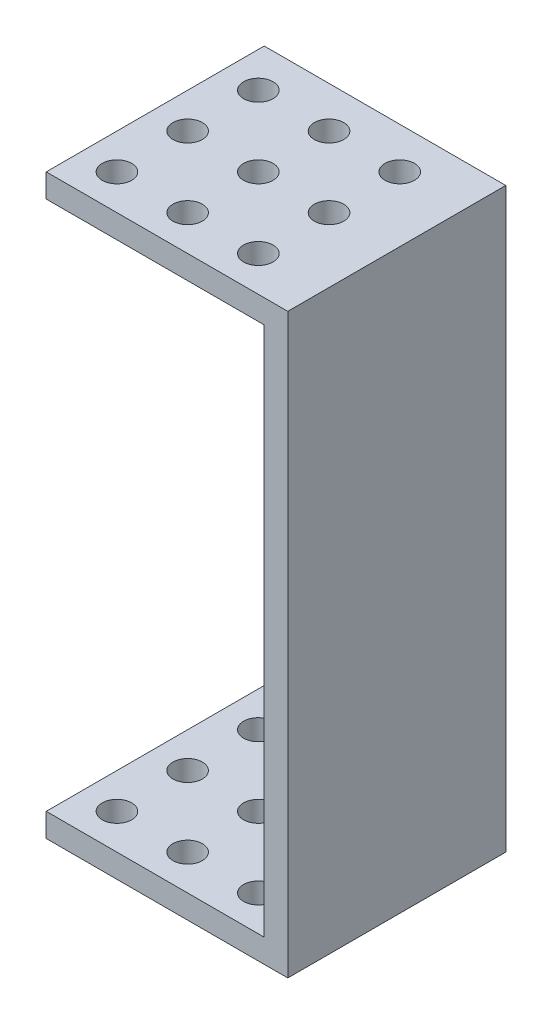
ISO-10303-21;
HEADER;
FILE_DESCRIPTION(('STEP AP214'),'2;1');
FILE_NAME('part.step','',(''),(''),'','','');
FILE_SCHEMA(('AUTOMOTIVE_DESIGN { 1 0 10303 214 1 1 1 1 }'));
ENDSEC;
DATA;
#1=APPLICATION_CONTEXT('core data for automotive mechanical design processes');
#2=APPLICATION_PROTOCOL_DEFINITION('international standard','automotive_design',2000,#1);
#3=PRODUCT_CONTEXT('',#1,'mechanical');
#4=PRODUCT('Part','Part','',(#3));
#5=PRODUCT_RELATED_PRODUCT_CATEGORY('part','',(#4));
#6=PRODUCT_DEFINITION_FORMATION('','',#4);
#7=PRODUCT_DEFINITION_CONTEXT('part definition',#1,'design');
#8=PRODUCT_DEFINITION('design','',#6,#7);
#9=PRODUCT_DEFINITION_SHAPE('','',#8);
#10=(LENGTH_UNIT() NAMED_UNIT(*) SI_UNIT(.MILLI.,.METRE.));
#11=(NAMED_UNIT(*) PLANE_ANGLE_UNIT() SI_UNIT($,.RADIAN.));
#12=(NAMED_UNIT(*) SI_UNIT($,.STERADIAN.) SOLID_ANGLE_UNIT());
#13=UNCERTAINTY_MEASURE_WITH_UNIT(LENGTH_MEASURE(1.E-05),#10,'distance_accuracy_value','');
#14=(GEOMETRIC_REPRESENTATION_CONTEXT(3) GLOBAL_UNCERTAINTY_ASSIGNED_CONTEXT((#13)) GLOBAL_UNIT_ASSIGNED_CONTEXT((#10,
#11,#12)) REPRESENTATION_CONTEXT('',''));
#15=CARTESIAN_POINT('',(0.,0.,0.));
#16=DIRECTION('',(0.,0.,1.));
#17=DIRECTION('',(1.,0.,0.));
#18=AXIS2_PLACEMENT_3D('',#15,#16,#17);
#19=CARTESIAN_POINT('',(-10.25,2.,9.25));
#20=DIRECTION('',(1.,0.,0.));
#21=DIRECTION('',(0.,0.,-1.));
#22=AXIS2_PLACEMENT_3D('',#19,#20,#21);
#23=PLANE('',#22);
#24=DIRECTION('',(0.,0.,1.));
#25=VECTOR('',#24,1.);
#26=CARTESIAN_POINT('',(-10.25,0.,9.25));
#27=LINE('',#26,#25);
#28=CARTESIAN_POINT('',(-10.25,0.,-9.25));
#29=VERTEX_POINT('',#28);
#30=CARTESIAN_POINT('',(-10.25,0.,9.25));
#31=VERTEX_POINT('',#30);
#32=EDGE_CURVE('E90',#29,#31,#27,.T.);
#33=ORIENTED_EDGE('',*,*,#32,.T.);
#34=DIRECTION('',(0.,-1.,0.));
#35=VECTOR('',#34,1.);
#36=CARTESIAN_POINT('',(-10.25,2.,9.25));
#37=LINE('',#36,#35);
#38=CARTESIAN_POINT('',(-10.25,2.,9.25));
#39=VERTEX_POINT('',#38);
#40=EDGE_CURVE('E111',#39,#31,#37,.T.);
#41=ORIENTED_EDGE('',*,*,#40,.F.);
#42=DIRECTION('',(0.,0.,1.));
#43=VECTOR('',#42,1.);
#44=CARTESIAN_POINT('',(-10.25,2.,9.25));
#45=LINE('',#44,#43);
#46=CARTESIAN_POINT('',(-10.25,2.,-9.25));
#47=VERTEX_POINT('',#46);
#48=EDGE_CURVE('E84',#47,#39,#45,.T.);
#49=ORIENTED_EDGE('',*,*,#48,.F.);
#50=DIRECTION('',(0.,-1.,0.));
#51=VECTOR('',#50,1.);
#52=CARTESIAN_POINT('',(-10.25,2.,-9.25));
#53=LINE('',#52,#51);
#54=EDGE_CURVE('E76',#47,#29,#53,.T.);
#55=ORIENTED_EDGE('',*,*,#54,.T.);
#56=EDGE_LOOP('',(#33,#41,#49,#55));
#57=FACE_BOUND('',#56,.T.);
#58=ADVANCED_FACE('F33',(#57),#23,.F.);
#59=CARTESIAN_POINT('',(10.25,2.,9.25));
#60=DIRECTION('',(0.,0.,-1.));
#61=DIRECTION('',(-1.,0.,0.));
#62=AXIS2_PLACEMENT_3D('',#59,#60,#61);
#63=PLANE('',#62);
#64=DIRECTION('',(1.,0.,0.));
#65=VECTOR('',#64,1.);
#66=CARTESIAN_POINT('',(10.25,0.,9.25));
#67=LINE('',#66,#65);
#68=CARTESIAN_POINT('',(10.25,0.,9.25));
#69=VERTEX_POINT('',#68);
#70=EDGE_CURVE('E94',#31,#69,#67,.T.);
#71=ORIENTED_EDGE('',*,*,#70,.T.);
#72=DIRECTION('',(0.,-1.,0.));
#73=VECTOR('',#72,1.);
#74=CARTESIAN_POINT('',(10.25,2.,9.25));
#75=LINE('',#74,#73);
#76=CARTESIAN_POINT('',(10.25,49.,9.25));
#77=VERTEX_POINT('',#76);
#78=EDGE_CURVE('E108',#77,#69,#75,.T.);
#79=ORIENTED_EDGE('',*,*,#78,.F.);
#80=DIRECTION('',(1.,0.,0.));
#81=VECTOR('',#80,1.);
#82=CARTESIAN_POINT('',(-10.25,49.,9.25));
#83=LINE('',#82,#81);
#84=CARTESIAN_POINT('',(-10.25,49.,9.25));
#85=VERTEX_POINT('',#84);
#86=EDGE_CURVE('E365',#85,#77,#83,.T.);
#87=ORIENTED_EDGE('',*,*,#86,.F.);
#88=DIRECTION('',(0.,-1.,0.));
#89=VECTOR('',#88,1.);
#90=CARTESIAN_POINT('',(-10.25,49.,9.25));
#91=LINE('',#90,#89);
#92=CARTESIAN_POINT('',(-10.25,47.,9.25));
#93=VERTEX_POINT('',#92);
#94=EDGE_CURVE('E368',#85,#93,#91,.T.);
#95=ORIENTED_EDGE('',*,*,#94,.T.);
#96=DIRECTION('',(1.,0.,0.));
#97=VECTOR('',#96,1.);
#98=CARTESIAN_POINT('',(-10.25,47.,9.25));
#99=LINE('',#98,#97);
#100=CARTESIAN_POINT('',(8.25,47.,9.25));
#101=VERTEX_POINT('',#100);
#102=EDGE_CURVE('E359',#93,#101,#99,.T.);
#103=ORIENTED_EDGE('',*,*,#102,.T.);
#104=DIRECTION('',(0.,-1.,0.));
#105=VECTOR('',#104,1.);
#106=CARTESIAN_POINT('',(8.25,47.,9.25));
#107=LINE('',#106,#105);
#108=CARTESIAN_POINT('',(8.25,2.,9.25));
#109=VERTEX_POINT('',#108);
#110=EDGE_CURVE('E100',#101,#109,#107,.T.);
#111=ORIENTED_EDGE('',*,*,#110,.T.);
#112=DIRECTION('',(1.,0.,0.));
#113=VECTOR('',#112,1.);
#114=CARTESIAN_POINT('',(10.25,2.,9.25));
#115=LINE('',#114,#113);
#116=EDGE_CURVE('E114',#39,#109,#115,.T.);
#117=ORIENTED_EDGE('',*,*,#116,.F.);
#118=ORIENTED_EDGE('',*,*,#40,.T.);
#119=EDGE_LOOP('',(#71,#79,#87,#95,#103,#111,#117,#118));
#120=FACE_BOUND('',#119,.T.);
#121=ADVANCED_FACE('F239',(#120),#63,.F.);
#122=CARTESIAN_POINT('',(10.25,2.,9.25));
#123=DIRECTION('',(-1.,0.,0.));
#124=DIRECTION('',(0.,0.,1.));
#125=AXIS2_PLACEMENT_3D('',#122,#123,#124);
#126=PLANE('',#125);
#127=DIRECTION('',(0.,0.,-1.));
#128=VECTOR('',#127,1.);
#129=CARTESIAN_POINT('',(10.25,0.,9.25));
#130=LINE('',#129,#128);
#131=CARTESIAN_POINT('',(10.25,0.,-9.25));
#132=VERTEX_POINT('',#131);
#133=EDGE_CURVE('E85',#69,#132,#130,.T.);
#134=ORIENTED_EDGE('',*,*,#133,.T.);
#135=DIRECTION('',(0.,-1.,0.));
#136=VECTOR('',#135,1.);
#137=CARTESIAN_POINT('',(10.25,2.,-9.25));
#138=LINE('',#137,#136);
#139=CARTESIAN_POINT('',(10.25,49.,-9.25));
#140=VERTEX_POINT('',#139);
#141=EDGE_CURVE('E80',#140,#132,#138,.T.);
#142=ORIENTED_EDGE('',*,*,#141,.F.);
#143=DIRECTION('',(0.,0.,-1.));
#144=VECTOR('',#143,1.);
#145=CARTESIAN_POINT('',(10.25,49.,-9.25));
#146=LINE('',#145,#144);
#147=EDGE_CURVE('E355',#77,#140,#146,.T.);
#148=ORIENTED_EDGE('',*,*,#147,.F.);
#149=ORIENTED_EDGE('',*,*,#78,.T.);
#150=EDGE_LOOP('',(#134,#142,#148,#149));
#151=FACE_BOUND('',#150,.T.);
#152=ADVANCED_FACE('F244',(#151),#126,.F.);
#153=CARTESIAN_POINT('',(10.25,2.,-9.25));
#154=DIRECTION('',(0.,0.,1.));
#155=DIRECTION('',(1.,0.,0.));
#156=AXIS2_PLACEMENT_3D('',#153,#154,#155);
#157=PLANE('',#156);
#158=DIRECTION('',(-1.,0.,0.));
#159=VECTOR('',#158,1.);
#160=CARTESIAN_POINT('',(10.25,0.,-9.25));
#161=LINE('',#160,#159);
#162=EDGE_CURVE('E73',#132,#29,#161,.T.);
#163=ORIENTED_EDGE('',*,*,#162,.T.);
#164=ORIENTED_EDGE('',*,*,#54,.F.);
#165=DIRECTION('',(-1.,0.,0.));
#166=VECTOR('',#165,1.);
#167=CARTESIAN_POINT('',(10.25,2.,-9.25));
#168=LINE('',#167,#166);
#169=CARTESIAN_POINT('',(8.25,2.,-9.25));
#170=VERTEX_POINT('',#169);
#171=EDGE_CURVE('E53',#170,#47,#168,.T.);
#172=ORIENTED_EDGE('',*,*,#171,.F.);
#173=DIRECTION('',(0.,-1.,0.));
#174=VECTOR('',#173,1.);
#175=CARTESIAN_POINT('',(8.25,47.,-9.25));
#176=LINE('',#175,#174);
#177=CARTESIAN_POINT('',(8.25,47.,-9.25));
#178=VERTEX_POINT('',#177);
#179=EDGE_CURVE('E96',#178,#170,#176,.T.);
#180=ORIENTED_EDGE('',*,*,#179,.F.);
#181=DIRECTION('',(-1.,0.,0.));
#182=VECTOR('',#181,1.);
#183=CARTESIAN_POINT('',(-10.25,47.,-9.25));
#184=LINE('',#183,#182);
#185=CARTESIAN_POINT('',(-10.25,47.,-9.25));
#186=VERTEX_POINT('',#185);
#187=EDGE_CURVE('E354',#178,#186,#184,.T.);
#188=ORIENTED_EDGE('',*,*,#187,.T.);
#189=DIRECTION('',(0.,-1.,0.));
#190=VECTOR('',#189,1.);
#191=CARTESIAN_POINT('',(-10.25,49.,-9.25));
#192=LINE('',#191,#190);
#193=CARTESIAN_POINT('',(-10.25,49.,-9.25));
#194=VERTEX_POINT('',#193);
#195=EDGE_CURVE('E126',#194,#186,#192,.T.);
#196=ORIENTED_EDGE('',*,*,#195,.F.);
#197=DIRECTION('',(-1.,0.,0.));
#198=VECTOR('',#197,1.);
#199=CARTESIAN_POINT('',(-10.25,49.,-9.25));
#200=LINE('',#199,#198);
#201=EDGE_CURVE('E358',#140,#194,#200,.T.);
#202=ORIENTED_EDGE('',*,*,#201,.F.);
#203=ORIENTED_EDGE('',*,*,#141,.T.);
#204=EDGE_LOOP('',(#163,#164,#172,#180,#188,#196,#202,#203));
#205=FACE_BOUND('',#204,.T.);
#206=ADVANCED_FACE('F75',(#205),#157,.F.);
#207=CARTESIAN_POINT('',(0.,2.,0.));
#208=DIRECTION('',(0.,1.,0.));
#209=DIRECTION('',(0.,0.,1.));
#210=AXIS2_PLACEMENT_3D('',#207,#208,#209);
#211=PLANE('',#210);
#212=CARTESIAN_POINT('',(-7.25,2.,0.250000000000001));
#213=DIRECTION('',(0.,1.,0.));
#214=DIRECTION('',(0.,0.,1.));
#215=AXIS2_PLACEMENT_3D('',#212,#213,#214);
#216=CIRCLE('',#215,1.25);
#217=CARTESIAN_POINT('',(-7.25,2.,1.5));
#218=VERTEX_POINT('',#217);
#219=EDGE_CURVE('E333',#218,#218,#216,.T.);
#220=ORIENTED_EDGE('',*,*,#219,.F.);
#221=EDGE_LOOP('',(#220));
#222=FACE_BOUND('',#221,.T.);
#223=CARTESIAN_POINT('',(-7.25,2.,6.25));
#224=DIRECTION('',(0.,1.,0.));
#225=DIRECTION('',(0.,0.,1.));
#226=AXIS2_PLACEMENT_3D('',#223,#224,#225);
#227=CIRCLE('',#226,1.25);
#228=CARTESIAN_POINT('',(-7.25,2.,7.5));
#229=VERTEX_POINT('',#228);
#230=EDGE_CURVE('E351',#229,#229,#227,.T.);
#231=ORIENTED_EDGE('',*,*,#230,.F.);
#232=EDGE_LOOP('',(#231));
#233=FACE_BOUND('',#232,.T.);
#234=DIRECTION('',(0.,0.,1.));
#235=VECTOR('',#234,1.);
#236=CARTESIAN_POINT('',(8.25,2.,9.25));
#237=LINE('',#236,#235);
#238=EDGE_CURVE('E48',#170,#109,#237,.T.);
#239=ORIENTED_EDGE('',*,*,#238,.F.);
#240=ORIENTED_EDGE('',*,*,#171,.T.);
#241=ORIENTED_EDGE('',*,*,#48,.T.);
#242=ORIENTED_EDGE('',*,*,#116,.T.);
#243=EDGE_LOOP('',(#239,#240,#241,#242));
#244=FACE_BOUND('',#243,.T.);
#245=CARTESIAN_POINT('',(-7.25,2.,-5.75));
#246=DIRECTION('',(0.,1.,0.));
#247=DIRECTION('',(0.,0.,1.));
#248=AXIS2_PLACEMENT_3D('',#245,#246,#247);
#249=CIRCLE('',#248,1.25);
#250=CARTESIAN_POINT('',(-7.25,2.,-4.5));
#251=VERTEX_POINT('',#250);
#252=EDGE_CURVE('E113',#251,#251,#249,.T.);
#253=ORIENTED_EDGE('',*,*,#252,.F.);
#254=EDGE_LOOP('',(#253));
#255=FACE_BOUND('',#254,.T.);
#256=CARTESIAN_POINT('',(-1.25,2.,6.25));
#257=DIRECTION('',(0.,1.,0.));
#258=DIRECTION('',(0.,0.,1.));
#259=AXIS2_PLACEMENT_3D('',#256,#257,#258);
#260=CIRCLE('',#259,1.25);
#261=CARTESIAN_POINT('',(-1.25,2.,7.5));
#262=VERTEX_POINT('',#261);
#263=EDGE_CURVE('E140',#262,#262,#260,.T.);
#264=ORIENTED_EDGE('',*,*,#263,.F.);
#265=EDGE_LOOP('',(#264));
#266=FACE_BOUND('',#265,.T.);
#267=CARTESIAN_POINT('',(-1.25,2.,0.25));
#268=DIRECTION('',(0.,1.,0.));
#269=DIRECTION('',(0.,0.,1.));
#270=AXIS2_PLACEMENT_3D('',#267,#268,#269);
#271=CIRCLE('',#270,1.25);
#272=CARTESIAN_POINT('',(-1.25,2.,1.5));
#273=VERTEX_POINT('',#272);
#274=EDGE_CURVE('E146',#273,#273,#271,.T.);
#275=ORIENTED_EDGE('',*,*,#274,.F.);
#276=EDGE_LOOP('',(#275));
#277=FACE_BOUND('',#276,.T.);
#278=CARTESIAN_POINT('',(-1.25,2.,-5.75));
#279=DIRECTION('',(0.,1.,0.));
#280=DIRECTION('',(0.,0.,1.));
#281=AXIS2_PLACEMENT_3D('',#278,#279,#280);
#282=CIRCLE('',#281,1.25);
#283=CARTESIAN_POINT('',(-1.25,2.,-4.5));
#284=VERTEX_POINT('',#283);
#285=EDGE_CURVE('E152',#284,#284,#282,.T.);
#286=ORIENTED_EDGE('',*,*,#285,.F.);
#287=EDGE_LOOP('',(#286));
#288=FACE_BOUND('',#287,.T.);
#289=CARTESIAN_POINT('',(4.75,2.,6.25));
#290=DIRECTION('',(0.,1.,0.));
#291=DIRECTION('',(0.,0.,1.));
#292=AXIS2_PLACEMENT_3D('',#289,#290,#291);
#293=CIRCLE('',#292,1.25);
#294=CARTESIAN_POINT('',(4.75,2.,7.5));
#295=VERTEX_POINT('',#294);
#296=EDGE_CURVE('E158',#295,#295,#293,.T.);
#297=ORIENTED_EDGE('',*,*,#296,.F.);
#298=EDGE_LOOP('',(#297));
#299=FACE_BOUND('',#298,.T.);
#300=CARTESIAN_POINT('',(4.75,2.,0.249999999999999));
#301=DIRECTION('',(0.,1.,0.));
#302=DIRECTION('',(0.,0.,1.));
#303=AXIS2_PLACEMENT_3D('',#300,#301,#302);
#304=CIRCLE('',#303,1.25);
#305=CARTESIAN_POINT('',(4.75,2.,1.5));
#306=VERTEX_POINT('',#305);
#307=EDGE_CURVE('E164',#306,#306,#304,.T.);
#308=ORIENTED_EDGE('',*,*,#307,.F.);
#309=EDGE_LOOP('',(#308));
#310=FACE_BOUND('',#309,.T.);
#311=CARTESIAN_POINT('',(4.75,2.,-5.75));
#312=DIRECTION('',(0.,1.,0.));
#313=DIRECTION('',(0.,0.,1.));
#314=AXIS2_PLACEMENT_3D('',#311,#312,#313);
#315=CIRCLE('',#314,1.25);
#316=CARTESIAN_POINT('',(4.75,2.,-4.5));
#317=VERTEX_POINT('',#316);
#318=EDGE_CURVE('E170',#317,#317,#315,.T.);
#319=ORIENTED_EDGE('',*,*,#318,.F.);
#320=EDGE_LOOP('',(#319));
#321=FACE_BOUND('',#320,.T.);
#322=ADVANCED_FACE('F415',(#222,#233,#244,#255,#266,#277,#288,#299,#310,#321),#211,.T.);
#323=CARTESIAN_POINT('',(0.,0.,0.));
#324=DIRECTION('',(0.,1.,0.));
#325=DIRECTION('',(0.,0.,1.));
#326=AXIS2_PLACEMENT_3D('',#323,#324,#325);
#327=PLANE('',#326);
#328=CARTESIAN_POINT('',(-7.25,0.,0.250000000000001));
#329=DIRECTION('',(0.,-1.,0.));
#330=DIRECTION('',(0.,0.,-1.));
#331=AXIS2_PLACEMENT_3D('',#328,#329,#330);
#332=CIRCLE('',#331,1.25);
#333=CARTESIAN_POINT('',(-7.25,0.,-0.999999999999999));
#334=VERTEX_POINT('',#333);
#335=EDGE_CURVE('E336',#334,#334,#332,.T.);
#336=ORIENTED_EDGE('',*,*,#335,.F.);
#337=EDGE_LOOP('',(#336));
#338=FACE_BOUND('',#337,.T.);
#339=CARTESIAN_POINT('',(-7.25,0.,6.25));
#340=DIRECTION('',(0.,-1.,0.));
#341=DIRECTION('',(0.,0.,-1.));
#342=AXIS2_PLACEMENT_3D('',#339,#340,#341);
#343=CIRCLE('',#342,1.25);
#344=CARTESIAN_POINT('',(-7.25,0.,5.));
#345=VERTEX_POINT('',#344);
#346=EDGE_CURVE('E342',#345,#345,#343,.T.);
#347=ORIENTED_EDGE('',*,*,#346,.F.);
#348=EDGE_LOOP('',(#347));
#349=FACE_BOUND('',#348,.T.);
#350=ORIENTED_EDGE('',*,*,#32,.F.);
#351=ORIENTED_EDGE('',*,*,#162,.F.);
#352=ORIENTED_EDGE('',*,*,#133,.F.);
#353=ORIENTED_EDGE('',*,*,#70,.F.);
#354=EDGE_LOOP('',(#350,#351,#352,#353));
#355=FACE_BOUND('',#354,.T.);
#356=CARTESIAN_POINT('',(-7.25,0.,-5.75));
#357=DIRECTION('',(0.,-1.,0.));
#358=DIRECTION('',(0.,0.,-1.));
#359=AXIS2_PLACEMENT_3D('',#356,#357,#358);
#360=CIRCLE('',#359,1.25);
#361=CARTESIAN_POINT('',(-7.25,0.,-7.));
#362=VERTEX_POINT('',#361);
#363=EDGE_CURVE('E137',#362,#362,#360,.T.);
#364=ORIENTED_EDGE('',*,*,#363,.F.);
#365=EDGE_LOOP('',(#364));
#366=FACE_BOUND('',#365,.T.);
#367=CARTESIAN_POINT('',(-1.25,0.,6.25));
#368=DIRECTION('',(0.,-1.,0.));
#369=DIRECTION('',(0.,0.,-1.));
#370=AXIS2_PLACEMENT_3D('',#367,#368,#369);
#371=CIRCLE('',#370,1.25);
#372=CARTESIAN_POINT('',(-1.25,0.,5.));
#373=VERTEX_POINT('',#372);
#374=EDGE_CURVE('E143',#373,#373,#371,.T.);
#375=ORIENTED_EDGE('',*,*,#374,.F.);
#376=EDGE_LOOP('',(#375));
#377=FACE_BOUND('',#376,.T.);
#378=CARTESIAN_POINT('',(-1.25,0.,0.25));
#379=DIRECTION('',(0.,-1.,0.));
#380=DIRECTION('',(0.,0.,-1.));
#381=AXIS2_PLACEMENT_3D('',#378,#379,#380);
#382=CIRCLE('',#381,1.25);
#383=CARTESIAN_POINT('',(-1.25,0.,-1.));
#384=VERTEX_POINT('',#383);
#385=EDGE_CURVE('E149',#384,#384,#382,.T.);
#386=ORIENTED_EDGE('',*,*,#385,.F.);
#387=EDGE_LOOP('',(#386));
#388=FACE_BOUND('',#387,.T.);
#389=CARTESIAN_POINT('',(-1.25,0.,-5.75));
#390=DIRECTION('',(0.,-1.,0.));
#391=DIRECTION('',(0.,0.,-1.));
#392=AXIS2_PLACEMENT_3D('',#389,#390,#391);
#393=CIRCLE('',#392,1.25);
#394=CARTESIAN_POINT('',(-1.25,0.,-7.));
#395=VERTEX_POINT('',#394);
#396=EDGE_CURVE('E155',#395,#395,#393,.T.);
#397=ORIENTED_EDGE('',*,*,#396,.F.);
#398=EDGE_LOOP('',(#397));
#399=FACE_BOUND('',#398,.T.);
#400=CARTESIAN_POINT('',(4.75,0.,6.25));
#401=DIRECTION('',(0.,-1.,0.));
#402=DIRECTION('',(0.,0.,-1.));
#403=AXIS2_PLACEMENT_3D('',#400,#401,#402);
#404=CIRCLE('',#403,1.25);
#405=CARTESIAN_POINT('',(4.75,0.,5.));
#406=VERTEX_POINT('',#405);
#407=EDGE_CURVE('E161',#406,#406,#404,.T.);
#408=ORIENTED_EDGE('',*,*,#407,.F.);
#409=EDGE_LOOP('',(#408));
#410=FACE_BOUND('',#409,.T.);
#411=CARTESIAN_POINT('',(4.75,0.,0.249999999999999));
#412=DIRECTION('',(0.,-1.,0.));
#413=DIRECTION('',(0.,0.,-1.));
#414=AXIS2_PLACEMENT_3D('',#411,#412,#413);
#415=CIRCLE('',#414,1.25);
#416=CARTESIAN_POINT('',(4.75,0.,-1.));
#417=VERTEX_POINT('',#416);
#418=EDGE_CURVE('E167',#417,#417,#415,.T.);
#419=ORIENTED_EDGE('',*,*,#418,.F.);
#420=EDGE_LOOP('',(#419));
#421=FACE_BOUND('',#420,.T.);
#422=CARTESIAN_POINT('',(4.75,0.,-5.75));
#423=DIRECTION('',(0.,-1.,0.));
#424=DIRECTION('',(0.,0.,-1.));
#425=AXIS2_PLACEMENT_3D('',#422,#423,#424);
#426=CIRCLE('',#425,1.25);
#427=CARTESIAN_POINT('',(4.75,0.,-7.));
#428=VERTEX_POINT('',#427);
#429=EDGE_CURVE('E173',#428,#428,#426,.T.);
#430=ORIENTED_EDGE('',*,*,#429,.F.);
#431=EDGE_LOOP('',(#430));
#432=FACE_BOUND('',#431,.T.);
#433=ADVANCED_FACE('F92',(#338,#349,#355,#366,#377,#388,#399,#410,#421,#432),#327,.F.);
#434=CARTESIAN_POINT('',(8.25,47.,9.25));
#435=DIRECTION('',(1.,0.,0.));
#436=DIRECTION('',(0.,0.,-1.));
#437=AXIS2_PLACEMENT_3D('',#434,#435,#436);
#438=PLANE('',#437);
#439=ORIENTED_EDGE('',*,*,#238,.T.);
#440=ORIENTED_EDGE('',*,*,#110,.F.);
#441=DIRECTION('',(0.,0.,1.));
#442=VECTOR('',#441,1.);
#443=CARTESIAN_POINT('',(8.25,47.,9.25));
#444=LINE('',#443,#442);
#445=EDGE_CURVE('E125',#178,#101,#444,.T.);
#446=ORIENTED_EDGE('',*,*,#445,.F.);
#447=ORIENTED_EDGE('',*,*,#179,.T.);
#448=EDGE_LOOP('',(#439,#440,#446,#447));
#449=FACE_BOUND('',#448,.T.);
#450=ADVANCED_FACE('F224',(#449),#438,.F.);
#451=CARTESIAN_POINT('',(0.,47.,0.));
#452=DIRECTION('',(0.,1.,0.));
#453=DIRECTION('',(0.,0.,1.));
#454=AXIS2_PLACEMENT_3D('',#451,#452,#453);
#455=PLANE('',#454);
#456=CARTESIAN_POINT('',(-7.25,47.,0.250000000000001));
#457=DIRECTION('',(0.,1.,0.));
#458=DIRECTION('',(0.,0.,1.));
#459=AXIS2_PLACEMENT_3D('',#456,#457,#458);
#460=CIRCLE('',#459,1.25);
#461=CARTESIAN_POINT('',(-7.25,47.,1.5));
#462=VERTEX_POINT('',#461);
#463=EDGE_CURVE('E332',#462,#462,#460,.T.);
#464=ORIENTED_EDGE('',*,*,#463,.T.);
#465=EDGE_LOOP('',(#464));
#466=FACE_BOUND('',#465,.T.);
#467=CARTESIAN_POINT('',(-7.25,47.,6.25));
#468=DIRECTION('',(0.,1.,0.));
#469=DIRECTION('',(0.,0.,1.));
#470=AXIS2_PLACEMENT_3D('',#467,#468,#469);
#471=CIRCLE('',#470,1.25);
#472=CARTESIAN_POINT('',(-7.25,47.,7.5));
#473=VERTEX_POINT('',#472);
#474=EDGE_CURVE('E346',#473,#473,#471,.T.);
#475=ORIENTED_EDGE('',*,*,#474,.T.);
#476=EDGE_LOOP('',(#475));
#477=FACE_BOUND('',#476,.T.);
#478=ORIENTED_EDGE('',*,*,#187,.F.);
#479=ORIENTED_EDGE('',*,*,#445,.T.);
#480=ORIENTED_EDGE('',*,*,#102,.F.);
#481=DIRECTION('',(0.,0.,1.));
#482=VECTOR('',#481,1.);
#483=CARTESIAN_POINT('',(-10.25,47.,-9.25));
#484=LINE('',#483,#482);
#485=EDGE_CURVE('E371',#186,#93,#484,.T.);
#486=ORIENTED_EDGE('',*,*,#485,.F.);
#487=EDGE_LOOP('',(#478,#479,#480,#486));
#488=FACE_BOUND('',#487,.T.);
#489=CARTESIAN_POINT('',(-7.25,47.,-5.75));
#490=DIRECTION('',(0.,1.,0.));
#491=DIRECTION('',(0.,0.,1.));
#492=AXIS2_PLACEMENT_3D('',#489,#490,#491);
#493=CIRCLE('',#492,1.25);
#494=CARTESIAN_POINT('',(-7.25,47.,-4.5));
#495=VERTEX_POINT('',#494);
#496=EDGE_CURVE('E179',#495,#495,#493,.T.);
#497=ORIENTED_EDGE('',*,*,#496,.T.);
#498=EDGE_LOOP('',(#497));
#499=FACE_BOUND('',#498,.T.);
#500=CARTESIAN_POINT('',(-1.25,47.,6.25));
#501=DIRECTION('',(0.,1.,0.));
#502=DIRECTION('',(0.,0.,1.));
#503=AXIS2_PLACEMENT_3D('',#500,#501,#502);
#504=CIRCLE('',#503,1.25);
#505=CARTESIAN_POINT('',(-1.25,47.,7.5));
#506=VERTEX_POINT('',#505);
#507=EDGE_CURVE('E185',#506,#506,#504,.T.);
#508=ORIENTED_EDGE('',*,*,#507,.T.);
#509=EDGE_LOOP('',(#508));
#510=FACE_BOUND('',#509,.T.);
#511=CARTESIAN_POINT('',(-1.25,47.,0.25));
#512=DIRECTION('',(0.,1.,0.));
#513=DIRECTION('',(0.,0.,1.));
#514=AXIS2_PLACEMENT_3D('',#511,#512,#513);
#515=CIRCLE('',#514,1.25);
#516=CARTESIAN_POINT('',(-1.25,47.,1.5));
#517=VERTEX_POINT('',#516);
#518=EDGE_CURVE('E191',#517,#517,#515,.T.);
#519=ORIENTED_EDGE('',*,*,#518,.T.);
#520=EDGE_LOOP('',(#519));
#521=FACE_BOUND('',#520,.T.);
#522=CARTESIAN_POINT('',(-1.25,47.,-5.75));
#523=DIRECTION('',(0.,1.,0.));
#524=DIRECTION('',(0.,0.,1.));
#525=AXIS2_PLACEMENT_3D('',#522,#523,#524);
#526=CIRCLE('',#525,1.25);
#527=CARTESIAN_POINT('',(-1.25,47.,-4.5));
#528=VERTEX_POINT('',#527);
#529=EDGE_CURVE('E197',#528,#528,#526,.T.);
#530=ORIENTED_EDGE('',*,*,#529,.T.);
#531=EDGE_LOOP('',(#530));
#532=FACE_BOUND('',#531,.T.);
#533=CARTESIAN_POINT('',(4.75,47.,6.25));
#534=DIRECTION('',(0.,1.,0.));
#535=DIRECTION('',(0.,0.,1.));
#536=AXIS2_PLACEMENT_3D('',#533,#534,#535);
#537=CIRCLE('',#536,1.25);
#538=CARTESIAN_POINT('',(4.75,47.,7.5));
#539=VERTEX_POINT('',#538);
#540=EDGE_CURVE('E203',#539,#539,#537,.T.);
#541=ORIENTED_EDGE('',*,*,#540,.T.);
#542=EDGE_LOOP('',(#541));
#543=FACE_BOUND('',#542,.T.);
#544=CARTESIAN_POINT('',(4.75,47.,0.249999999999999));
#545=DIRECTION('',(0.,1.,0.));
#546=DIRECTION('',(0.,0.,1.));
#547=AXIS2_PLACEMENT_3D('',#544,#545,#546);
#548=CIRCLE('',#547,1.25);
#549=CARTESIAN_POINT('',(4.75,47.,1.5));
#550=VERTEX_POINT('',#549);
#551=EDGE_CURVE('E209',#550,#550,#548,.T.);
#552=ORIENTED_EDGE('',*,*,#551,.T.);
#553=EDGE_LOOP('',(#552));
#554=FACE_BOUND('',#553,.T.);
#555=CARTESIAN_POINT('',(4.75,47.,-5.75));
#556=DIRECTION('',(0.,1.,0.));
#557=DIRECTION('',(0.,0.,1.));
#558=AXIS2_PLACEMENT_3D('',#555,#556,#557);
#559=CIRCLE('',#558,1.25);
#560=CARTESIAN_POINT('',(4.75,47.,-4.5));
#561=VERTEX_POINT('',#560);
#562=EDGE_CURVE('E11',#561,#561,#559,.T.);
#563=ORIENTED_EDGE('',*,*,#562,.T.);
#564=EDGE_LOOP('',(#563));
#565=FACE_BOUND('',#564,.T.);
#566=ADVANCED_FACE('F221',(#466,#477,#488,#499,#510,#521,#532,#543,#554,#565),#455,.F.);
#567=CARTESIAN_POINT('',(-10.25,49.,-9.25));
#568=DIRECTION('',(1.,0.,0.));
#569=DIRECTION('',(0.,0.,-1.));
#570=AXIS2_PLACEMENT_3D('',#567,#568,#569);
#571=PLANE('',#570);
#572=ORIENTED_EDGE('',*,*,#485,.T.);
#573=ORIENTED_EDGE('',*,*,#94,.F.);
#574=DIRECTION('',(0.,0.,1.));
#575=VECTOR('',#574,1.);
#576=CARTESIAN_POINT('',(-10.25,49.,-9.25));
#577=LINE('',#576,#575);
#578=EDGE_CURVE('E362',#194,#85,#577,.T.);
#579=ORIENTED_EDGE('',*,*,#578,.F.);
#580=ORIENTED_EDGE('',*,*,#195,.T.);
#581=EDGE_LOOP('',(#572,#573,#579,#580));
#582=FACE_BOUND('',#581,.T.);
#583=ADVANCED_FACE('F223',(#582),#571,.F.);
#584=CARTESIAN_POINT('',(0.,49.,0.));
#585=DIRECTION('',(0.,1.,0.));
#586=DIRECTION('',(0.,0.,1.));
#587=AXIS2_PLACEMENT_3D('',#584,#585,#586);
#588=PLANE('',#587);
#589=CARTESIAN_POINT('',(-7.25,49.,0.250000000000001));
#590=DIRECTION('',(0.,-1.,0.));
#591=DIRECTION('',(0.,0.,-1.));
#592=AXIS2_PLACEMENT_3D('',#589,#590,#591);
#593=CIRCLE('',#592,1.25);
#594=CARTESIAN_POINT('',(-7.25,49.,-0.999999999999999));
#595=VERTEX_POINT('',#594);
#596=EDGE_CURVE('E330',#595,#595,#593,.T.);
#597=ORIENTED_EDGE('',*,*,#596,.T.);
#598=EDGE_LOOP('',(#597));
#599=FACE_BOUND('',#598,.T.);
#600=CARTESIAN_POINT('',(-7.25,49.,6.25));
#601=DIRECTION('',(0.,-1.,0.));
#602=DIRECTION('',(0.,0.,-1.));
#603=AXIS2_PLACEMENT_3D('',#600,#601,#602);
#604=CIRCLE('',#603,1.25);
#605=CARTESIAN_POINT('',(-7.25,49.,5.));
#606=VERTEX_POINT('',#605);
#607=EDGE_CURVE('E343',#606,#606,#604,.T.);
#608=ORIENTED_EDGE('',*,*,#607,.T.);
#609=EDGE_LOOP('',(#608));
#610=FACE_BOUND('',#609,.T.);
#611=ORIENTED_EDGE('',*,*,#147,.T.);
#612=ORIENTED_EDGE('',*,*,#201,.T.);
#613=ORIENTED_EDGE('',*,*,#578,.T.);
#614=ORIENTED_EDGE('',*,*,#86,.T.);
#615=EDGE_LOOP('',(#611,#612,#613,#614));
#616=FACE_BOUND('',#615,.T.);
#617=CARTESIAN_POINT('',(-7.25,49.,-5.75));
#618=DIRECTION('',(0.,-1.,0.));
#619=DIRECTION('',(0.,0.,-1.));
#620=AXIS2_PLACEMENT_3D('',#617,#618,#619);
#621=CIRCLE('',#620,1.25);
#622=CARTESIAN_POINT('',(-7.25,49.,-7.));
#623=VERTEX_POINT('',#622);
#624=EDGE_CURVE('E176',#623,#623,#621,.T.);
#625=ORIENTED_EDGE('',*,*,#624,.T.);
#626=EDGE_LOOP('',(#625));
#627=FACE_BOUND('',#626,.T.);
#628=CARTESIAN_POINT('',(-1.25,49.,6.25));
#629=DIRECTION('',(0.,-1.,0.));
#630=DIRECTION('',(0.,0.,-1.));
#631=AXIS2_PLACEMENT_3D('',#628,#629,#630);
#632=CIRCLE('',#631,1.25);
#633=CARTESIAN_POINT('',(-1.25,49.,5.));
#634=VERTEX_POINT('',#633);
#635=EDGE_CURVE('E182',#634,#634,#632,.T.);
#636=ORIENTED_EDGE('',*,*,#635,.T.);
#637=EDGE_LOOP('',(#636));
#638=FACE_BOUND('',#637,.T.);
#639=CARTESIAN_POINT('',(-1.25,49.,0.25));
#640=DIRECTION('',(0.,-1.,0.));
#641=DIRECTION('',(0.,0.,-1.));
#642=AXIS2_PLACEMENT_3D('',#639,#640,#641);
#643=CIRCLE('',#642,1.25);
#644=CARTESIAN_POINT('',(-1.25,49.,-1.));
#645=VERTEX_POINT('',#644);
#646=EDGE_CURVE('E188',#645,#645,#643,.T.);
#647=ORIENTED_EDGE('',*,*,#646,.T.);
#648=EDGE_LOOP('',(#647));
#649=FACE_BOUND('',#648,.T.);
#650=CARTESIAN_POINT('',(-1.25,49.,-5.75));
#651=DIRECTION('',(0.,-1.,0.));
#652=DIRECTION('',(0.,0.,-1.));
#653=AXIS2_PLACEMENT_3D('',#650,#651,#652);
#654=CIRCLE('',#653,1.25);
#655=CARTESIAN_POINT('',(-1.25,49.,-7.));
#656=VERTEX_POINT('',#655);
#657=EDGE_CURVE('E194',#656,#656,#654,.T.);
#658=ORIENTED_EDGE('',*,*,#657,.T.);
#659=EDGE_LOOP('',(#658));
#660=FACE_BOUND('',#659,.T.);
#661=CARTESIAN_POINT('',(4.75,49.,6.25));
#662=DIRECTION('',(0.,-1.,0.));
#663=DIRECTION('',(0.,0.,-1.));
#664=AXIS2_PLACEMENT_3D('',#661,#662,#663);
#665=CIRCLE('',#664,1.25);
#666=CARTESIAN_POINT('',(4.75,49.,5.));
#667=VERTEX_POINT('',#666);
#668=EDGE_CURVE('E200',#667,#667,#665,.T.);
#669=ORIENTED_EDGE('',*,*,#668,.T.);
#670=EDGE_LOOP('',(#669));
#671=FACE_BOUND('',#670,.T.);
#672=CARTESIAN_POINT('',(4.75,49.,0.249999999999999));
#673=DIRECTION('',(0.,-1.,0.));
#674=DIRECTION('',(0.,0.,-1.));
#675=AXIS2_PLACEMENT_3D('',#672,#673,#674);
#676=CIRCLE('',#675,1.25);
#677=CARTESIAN_POINT('',(4.75,49.,-1.));
#678=VERTEX_POINT('',#677);
#679=EDGE_CURVE('E206',#678,#678,#676,.T.);
#680=ORIENTED_EDGE('',*,*,#679,.T.);
#681=EDGE_LOOP('',(#680));
#682=FACE_BOUND('',#681,.T.);
#683=CARTESIAN_POINT('',(4.75,49.,-5.75));
#684=DIRECTION('',(0.,-1.,0.));
#685=DIRECTION('',(0.,0.,-1.));
#686=AXIS2_PLACEMENT_3D('',#683,#684,#685);
#687=CIRCLE('',#686,1.25);
#688=CARTESIAN_POINT('',(4.75,49.,-7.));
#689=VERTEX_POINT('',#688);
#690=EDGE_CURVE('E41',#689,#689,#687,.T.);
#691=ORIENTED_EDGE('',*,*,#690,.T.);
#692=EDGE_LOOP('',(#691));
#693=FACE_BOUND('',#692,.T.);
#694=ADVANCED_FACE('F214',(#599,#610,#616,#627,#638,#649,#660,#671,#682,#693),#588,.T.);
#695=CARTESIAN_POINT('',(-7.25,49.,6.25));
#696=DIRECTION('',(0.,-1.,0.));
#697=DIRECTION('',(0.,0.,-1.));
#698=AXIS2_PLACEMENT_3D('',#695,#696,#697);
#699=CYLINDRICAL_SURFACE('',#698,1.25);
#700=ORIENTED_EDGE('',*,*,#607,.F.);
#701=EDGE_LOOP('',(#700));
#702=FACE_BOUND('',#701,.T.);
#703=ORIENTED_EDGE('',*,*,#474,.F.);
#704=EDGE_LOOP('',(#703));
#705=FACE_BOUND('',#704,.T.);
#706=ADVANCED_FACE('F308',(#702,#705),#699,.F.);
#707=ORIENTED_EDGE('',*,*,#230,.T.);
#708=EDGE_LOOP('',(#707));
#709=FACE_BOUND('',#708,.T.);
#710=ORIENTED_EDGE('',*,*,#346,.T.);
#711=EDGE_LOOP('',(#710));
#712=FACE_BOUND('',#711,.T.);
#713=ADVANCED_FACE('F313',(#709,#712),#699,.F.);
#714=CARTESIAN_POINT('',(-7.25,49.,0.250000000000001));
#715=DIRECTION('',(0.,-1.,0.));
#716=DIRECTION('',(0.,0.,-1.));
#717=AXIS2_PLACEMENT_3D('',#714,#715,#716);
#718=CYLINDRICAL_SURFACE('',#717,1.25);
#719=ORIENTED_EDGE('',*,*,#219,.T.);
#720=EDGE_LOOP('',(#719));
#721=FACE_BOUND('',#720,.T.);
#722=ORIENTED_EDGE('',*,*,#335,.T.);
#723=EDGE_LOOP('',(#722));
#724=FACE_BOUND('',#723,.T.);
#725=ADVANCED_FACE('F253',(#721,#724),#718,.F.);
#726=CARTESIAN_POINT('',(-7.25,49.,-5.75));
#727=DIRECTION('',(0.,-1.,0.));
#728=DIRECTION('',(0.,0.,-1.));
#729=AXIS2_PLACEMENT_3D('',#726,#727,#728);
#730=CYLINDRICAL_SURFACE('',#729,1.25);
#731=ORIENTED_EDGE('',*,*,#252,.T.);
#732=EDGE_LOOP('',(#731));
#733=FACE_BOUND('',#732,.T.);
#734=ORIENTED_EDGE('',*,*,#363,.T.);
#735=EDGE_LOOP('',(#734));
#736=FACE_BOUND('',#735,.T.);
#737=ADVANCED_FACE('F249',(#733,#736),#730,.F.);
#738=CARTESIAN_POINT('',(-1.25,49.,6.25));
#739=DIRECTION('',(0.,-1.,0.));
#740=DIRECTION('',(0.,0.,-1.));
#741=AXIS2_PLACEMENT_3D('',#738,#739,#740);
#742=CYLINDRICAL_SURFACE('',#741,1.25);
#743=ORIENTED_EDGE('',*,*,#263,.T.);
#744=EDGE_LOOP('',(#743));
#745=FACE_BOUND('',#744,.T.);
#746=ORIENTED_EDGE('',*,*,#374,.T.);
#747=EDGE_LOOP('',(#746));
#748=FACE_BOUND('',#747,.T.);
#749=ADVANCED_FACE('F252',(#745,#748),#742,.F.);
#750=CARTESIAN_POINT('',(-1.25,49.,0.25));
#751=DIRECTION('',(0.,-1.,0.));
#752=DIRECTION('',(0.,0.,-1.));
#753=AXIS2_PLACEMENT_3D('',#750,#751,#752);
#754=CYLINDRICAL_SURFACE('',#753,1.25);
#755=ORIENTED_EDGE('',*,*,#274,.T.);
#756=EDGE_LOOP('',(#755));
#757=FACE_BOUND('',#756,.T.);
#758=ORIENTED_EDGE('',*,*,#385,.T.);
#759=EDGE_LOOP('',(#758));
#760=FACE_BOUND('',#759,.T.);
#761=ADVANCED_FACE('F257',(#757,#760),#754,.F.);
#762=CARTESIAN_POINT('',(-1.25,49.,-5.75));
#763=DIRECTION('',(0.,-1.,0.));
#764=DIRECTION('',(0.,0.,-1.));
#765=AXIS2_PLACEMENT_3D('',#762,#763,#764);
#766=CYLINDRICAL_SURFACE('',#765,1.25);
#767=ORIENTED_EDGE('',*,*,#285,.T.);
#768=EDGE_LOOP('',(#767));
#769=FACE_BOUND('',#768,.T.);
#770=ORIENTED_EDGE('',*,*,#396,.T.);
#771=EDGE_LOOP('',(#770));
#772=FACE_BOUND('',#771,.T.);
#773=ADVANCED_FACE('F261',(#769,#772),#766,.F.);
#774=CARTESIAN_POINT('',(4.75,49.,6.25));
#775=DIRECTION('',(0.,-1.,0.));
#776=DIRECTION('',(0.,0.,-1.));
#777=AXIS2_PLACEMENT_3D('',#774,#775,#776);
#778=CYLINDRICAL_SURFACE('',#777,1.25);
#779=ORIENTED_EDGE('',*,*,#296,.T.);
#780=EDGE_LOOP('',(#779));
#781=FACE_BOUND('',#780,.T.);
#782=ORIENTED_EDGE('',*,*,#407,.T.);
#783=EDGE_LOOP('',(#782));
#784=FACE_BOUND('',#783,.T.);
#785=ADVANCED_FACE('F265',(#781,#784),#778,.F.);
#786=CARTESIAN_POINT('',(4.75,49.,0.249999999999999));
#787=DIRECTION('',(0.,-1.,0.));
#788=DIRECTION('',(0.,0.,-1.));
#789=AXIS2_PLACEMENT_3D('',#786,#787,#788);
#790=CYLINDRICAL_SURFACE('',#789,1.25);
#791=ORIENTED_EDGE('',*,*,#307,.T.);
#792=EDGE_LOOP('',(#791));
#793=FACE_BOUND('',#792,.T.);
#794=ORIENTED_EDGE('',*,*,#418,.T.);
#795=EDGE_LOOP('',(#794));
#796=FACE_BOUND('',#795,.T.);
#797=ADVANCED_FACE('F269',(#793,#796),#790,.F.);
#798=CARTESIAN_POINT('',(4.75,49.,-5.75));
#799=DIRECTION('',(0.,-1.,0.));
#800=DIRECTION('',(0.,0.,-1.));
#801=AXIS2_PLACEMENT_3D('',#798,#799,#800);
#802=CYLINDRICAL_SURFACE('',#801,1.25);
#803=ORIENTED_EDGE('',*,*,#318,.T.);
#804=EDGE_LOOP('',(#803));
#805=FACE_BOUND('',#804,.T.);
#806=ORIENTED_EDGE('',*,*,#429,.T.);
#807=EDGE_LOOP('',(#806));
#808=FACE_BOUND('',#807,.T.);
#809=ADVANCED_FACE('F273',(#805,#808),#802,.F.);
#810=CARTESIAN_POINT('',(-7.25,49.,0.250000000000001));
#811=DIRECTION('',(0.,-1.,0.));
#812=DIRECTION('',(0.,0.,-1.));
#813=AXIS2_PLACEMENT_3D('',#810,#811,#812);
#814=CYLINDRICAL_SURFACE('',#813,1.25);
#815=ORIENTED_EDGE('',*,*,#596,.F.);
#816=EDGE_LOOP('',(#815));
#817=FACE_BOUND('',#816,.T.);
#818=ORIENTED_EDGE('',*,*,#463,.F.);
#819=EDGE_LOOP('',(#818));
#820=FACE_BOUND('',#819,.T.);
#821=ADVANCED_FACE('F277',(#817,#820),#814,.F.);
#822=CARTESIAN_POINT('',(-7.25,49.,-5.75));
#823=DIRECTION('',(0.,-1.,0.));
#824=DIRECTION('',(0.,0.,-1.));
#825=AXIS2_PLACEMENT_3D('',#822,#823,#824);
#826=CYLINDRICAL_SURFACE('',#825,1.25);
#827=ORIENTED_EDGE('',*,*,#624,.F.);
#828=EDGE_LOOP('',(#827));
#829=FACE_BOUND('',#828,.T.);
#830=ORIENTED_EDGE('',*,*,#496,.F.);
#831=EDGE_LOOP('',(#830));
#832=FACE_BOUND('',#831,.T.);
#833=ADVANCED_FACE('F279',(#829,#832),#826,.F.);
#834=CARTESIAN_POINT('',(-1.25,49.,6.25));
#835=DIRECTION('',(0.,-1.,0.));
#836=DIRECTION('',(0.,0.,-1.));
#837=AXIS2_PLACEMENT_3D('',#834,#835,#836);
#838=CYLINDRICAL_SURFACE('',#837,1.25);
#839=ORIENTED_EDGE('',*,*,#635,.F.);
#840=EDGE_LOOP('',(#839));
#841=FACE_BOUND('',#840,.T.);
#842=ORIENTED_EDGE('',*,*,#507,.F.);
#843=EDGE_LOOP('',(#842));
#844=FACE_BOUND('',#843,.T.);
#845=ADVANCED_FACE('F282',(#841,#844),#838,.F.);
#846=CARTESIAN_POINT('',(-1.25,49.,0.25));
#847=DIRECTION('',(0.,-1.,0.));
#848=DIRECTION('',(0.,0.,-1.));
#849=AXIS2_PLACEMENT_3D('',#846,#847,#848);
#850=CYLINDRICAL_SURFACE('',#849,1.25);
#851=ORIENTED_EDGE('',*,*,#646,.F.);
#852=EDGE_LOOP('',(#851));
#853=FACE_BOUND('',#852,.T.);
#854=ORIENTED_EDGE('',*,*,#518,.F.);
#855=EDGE_LOOP('',(#854));
#856=FACE_BOUND('',#855,.T.);
#857=ADVANCED_FACE('F286',(#853,#856),#850,.F.);
#858=CARTESIAN_POINT('',(-1.25,49.,-5.75));
#859=DIRECTION('',(0.,-1.,0.));
#860=DIRECTION('',(0.,0.,-1.));
#861=AXIS2_PLACEMENT_3D('',#858,#859,#860);
#862=CYLINDRICAL_SURFACE('',#861,1.25);
#863=ORIENTED_EDGE('',*,*,#657,.F.);
#864=EDGE_LOOP('',(#863));
#865=FACE_BOUND('',#864,.T.);
#866=ORIENTED_EDGE('',*,*,#529,.F.);
#867=EDGE_LOOP('',(#866));
#868=FACE_BOUND('',#867,.T.);
#869=ADVANCED_FACE('F290',(#865,#868),#862,.F.);
#870=CARTESIAN_POINT('',(4.75,49.,6.25));
#871=DIRECTION('',(0.,-1.,0.));
#872=DIRECTION('',(0.,0.,-1.));
#873=AXIS2_PLACEMENT_3D('',#870,#871,#872);
#874=CYLINDRICAL_SURFACE('',#873,1.25);
#875=ORIENTED_EDGE('',*,*,#668,.F.);
#876=EDGE_LOOP('',(#875));
#877=FACE_BOUND('',#876,.T.);
#878=ORIENTED_EDGE('',*,*,#540,.F.);
#879=EDGE_LOOP('',(#878));
#880=FACE_BOUND('',#879,.T.);
#881=ADVANCED_FACE('F294',(#877,#880),#874,.F.);
#882=CARTESIAN_POINT('',(4.75,49.,0.249999999999999));
#883=DIRECTION('',(0.,-1.,0.));
#884=DIRECTION('',(0.,0.,-1.));
#885=AXIS2_PLACEMENT_3D('',#882,#883,#884);
#886=CYLINDRICAL_SURFACE('',#885,1.25);
#887=ORIENTED_EDGE('',*,*,#679,.F.);
#888=EDGE_LOOP('',(#887));
#889=FACE_BOUND('',#888,.T.);
#890=ORIENTED_EDGE('',*,*,#551,.F.);
#891=EDGE_LOOP('',(#890));
#892=FACE_BOUND('',#891,.T.);
#893=ADVANCED_FACE('F218',(#889,#892),#886,.F.);
#894=CARTESIAN_POINT('',(4.75,49.,-5.75));
#895=DIRECTION('',(0.,-1.,0.));
#896=DIRECTION('',(0.,0.,-1.));
#897=AXIS2_PLACEMENT_3D('',#894,#895,#896);
#898=CYLINDRICAL_SURFACE('',#897,1.25);
#899=ORIENTED_EDGE('',*,*,#690,.F.);
#900=EDGE_LOOP('',(#899));
#901=FACE_BOUND('',#900,.T.);
#902=ORIENTED_EDGE('',*,*,#562,.F.);
#903=EDGE_LOOP('',(#902));
#904=FACE_BOUND('',#903,.T.);
#905=ADVANCED_FACE('F35',(#901,#904),#898,.F.);
#906=CLOSED_SHELL('',(#58,#121,#152,#206,#322,#433,#450,#566,#583,#694,#706,#713,#725,#737,#749,
#761,#773,#785,#797,#809,#821,#833,#845,#857,#869,#881,#893,#905));
#907=MANIFOLD_SOLID_BREP('B2',#906);
#908=ADVANCED_BREP_SHAPE_REPRESENTATION('',(#18,#907),#14);
#909=SHAPE_DEFINITION_REPRESENTATION(#9,#908);
ENDSEC;
END-ISO-10303-21;
